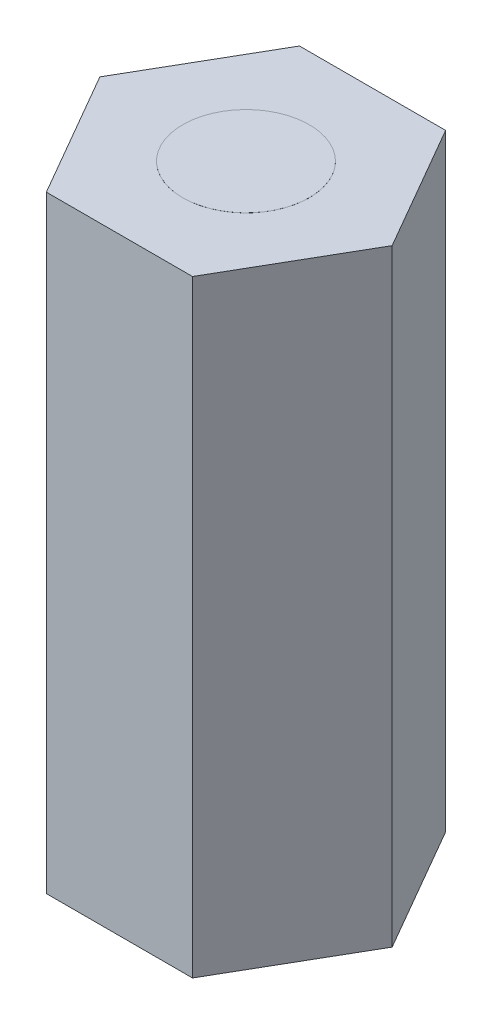
ISO-10303-21;
HEADER;
FILE_DESCRIPTION(('STEP AP214'),'2;1');
FILE_NAME('part.step','',(''),(''),'','','');
FILE_SCHEMA(('AUTOMOTIVE_DESIGN { 1 0 10303 214 1 1 1 1 }'));
ENDSEC;
DATA;
#1=APPLICATION_CONTEXT('core data for automotive mechanical design processes');
#2=APPLICATION_PROTOCOL_DEFINITION('international standard','automotive_design',2000,#1);
#3=PRODUCT_CONTEXT('',#1,'mechanical');
#4=PRODUCT('Part','Part','',(#3));
#5=PRODUCT_RELATED_PRODUCT_CATEGORY('part','',(#4));
#6=PRODUCT_DEFINITION_FORMATION('','',#4);
#7=PRODUCT_DEFINITION_CONTEXT('part definition',#1,'design');
#8=PRODUCT_DEFINITION('design','',#6,#7);
#9=PRODUCT_DEFINITION_SHAPE('','',#8);
#10=(LENGTH_UNIT() NAMED_UNIT(*) SI_UNIT(.MILLI.,.METRE.));
#11=(NAMED_UNIT(*) PLANE_ANGLE_UNIT() SI_UNIT($,.RADIAN.));
#12=(NAMED_UNIT(*) SI_UNIT($,.STERADIAN.) SOLID_ANGLE_UNIT());
#13=UNCERTAINTY_MEASURE_WITH_UNIT(LENGTH_MEASURE(1.E-05),#10,'distance_accuracy_value','');
#14=(GEOMETRIC_REPRESENTATION_CONTEXT(3) GLOBAL_UNCERTAINTY_ASSIGNED_CONTEXT((#13)) GLOBAL_UNIT_ASSIGNED_CONTEXT((#10,
#11,#12)) REPRESENTATION_CONTEXT('',''));
#15=CARTESIAN_POINT('',(0.,0.,0.));
#16=DIRECTION('',(0.,0.,1.));
#17=DIRECTION('',(1.,0.,0.));
#18=AXIS2_PLACEMENT_3D('',#15,#16,#17);
#19=CARTESIAN_POINT('',(-1.44337567297409,12.,-2.49999999999999));
#20=DIRECTION('',(0.866025403784441,0.,0.499999999999995));
#21=DIRECTION('',(0.499999999999995,0.,-0.866025403784442));
#22=AXIS2_PLACEMENT_3D('',#19,#20,#21);
#23=PLANE('',#22);
#24=DIRECTION('',(-0.499999999999995,0.,0.866025403784441));
#25=VECTOR('',#24,1.);
#26=CARTESIAN_POINT('',(-1.44337567297409,0.,-2.49999999999999));
#27=LINE('',#26,#25);
#28=CARTESIAN_POINT('',(-1.44337567297409,0.,-2.49999999999999));
#29=VERTEX_POINT('',#28);
#30=CARTESIAN_POINT('',(-2.88675134594813,0.,0.));
#31=VERTEX_POINT('',#30);
#32=EDGE_CURVE('E134',#29,#31,#27,.T.);
#33=ORIENTED_EDGE('',*,*,#32,.T.);
#34=DIRECTION('',(0.,-1.,0.));
#35=VECTOR('',#34,1.);
#36=CARTESIAN_POINT('',(-2.88675134594813,12.,0.));
#37=LINE('',#36,#35);
#38=CARTESIAN_POINT('',(-2.88675134594813,12.,0.));
#39=VERTEX_POINT('',#38);
#40=EDGE_CURVE('E46',#39,#31,#37,.T.);
#41=ORIENTED_EDGE('',*,*,#40,.F.);
#42=DIRECTION('',(-0.499999999999995,0.,0.866025403784441));
#43=VECTOR('',#42,1.);
#44=CARTESIAN_POINT('',(-1.44337567297409,12.,-2.49999999999999));
#45=LINE('',#44,#43);
#46=CARTESIAN_POINT('',(-1.44337567297409,12.,-2.49999999999999));
#47=VERTEX_POINT('',#46);
#48=EDGE_CURVE('E151',#47,#39,#45,.T.);
#49=ORIENTED_EDGE('',*,*,#48,.F.);
#50=DIRECTION('',(0.,-1.,0.));
#51=VECTOR('',#50,1.);
#52=CARTESIAN_POINT('',(-1.44337567297409,12.,-2.49999999999999));
#53=LINE('',#52,#51);
#54=EDGE_CURVE('E130',#47,#29,#53,.T.);
#55=ORIENTED_EDGE('',*,*,#54,.T.);
#56=EDGE_LOOP('',(#33,#41,#49,#55));
#57=FACE_BOUND('',#56,.T.);
#58=ADVANCED_FACE('F43',(#57),#23,.F.);
#59=CARTESIAN_POINT('',(-2.88675134594813,12.,0.));
#60=DIRECTION('',(0.866025403784438,0.,-0.500000000000001));
#61=DIRECTION('',(-0.500000000000001,0.,-0.866025403784438));
#62=AXIS2_PLACEMENT_3D('',#59,#60,#61);
#63=PLANE('',#62);
#64=DIRECTION('',(0.500000000000001,0.,0.866025403784438));
#65=VECTOR('',#64,1.);
#66=CARTESIAN_POINT('',(-2.88675134594813,0.,0.));
#67=LINE('',#66,#65);
#68=CARTESIAN_POINT('',(-1.44337567297406,0.,2.50000000000001));
#69=VERTEX_POINT('',#68);
#70=EDGE_CURVE('E138',#31,#69,#67,.T.);
#71=ORIENTED_EDGE('',*,*,#70,.T.);
#72=DIRECTION('',(0.,-1.,0.));
#73=VECTOR('',#72,1.);
#74=CARTESIAN_POINT('',(-1.44337567297406,12.,2.50000000000001));
#75=LINE('',#74,#73);
#76=CARTESIAN_POINT('',(-1.44337567297406,12.,2.50000000000001));
#77=VERTEX_POINT('',#76);
#78=EDGE_CURVE('E157',#77,#69,#75,.T.);
#79=ORIENTED_EDGE('',*,*,#78,.F.);
#80=DIRECTION('',(0.500000000000001,0.,0.866025403784438));
#81=VECTOR('',#80,1.);
#82=CARTESIAN_POINT('',(-2.88675134594813,12.,0.));
#83=LINE('',#82,#81);
#84=EDGE_CURVE('E99',#39,#77,#83,.T.);
#85=ORIENTED_EDGE('',*,*,#84,.F.);
#86=ORIENTED_EDGE('',*,*,#40,.T.);
#87=EDGE_LOOP('',(#71,#79,#85,#86));
#88=FACE_BOUND('',#87,.T.);
#89=ADVANCED_FACE('F164',(#88),#63,.F.);
#90=CARTESIAN_POINT('',(-1.44337567297406,12.,2.50000000000001));
#91=DIRECTION('',(0.,0.,-1.));
#92=DIRECTION('',(-1.,0.,0.));
#93=AXIS2_PLACEMENT_3D('',#90,#91,#92);
#94=PLANE('',#93);
#95=DIRECTION('',(1.,0.,0.));
#96=VECTOR('',#95,1.);
#97=CARTESIAN_POINT('',(-1.44337567297406,0.,2.50000000000001));
#98=LINE('',#97,#96);
#99=CARTESIAN_POINT('',(1.44337567297408,0.,2.5));
#100=VERTEX_POINT('',#99);
#101=EDGE_CURVE('E142',#69,#100,#98,.T.);
#102=ORIENTED_EDGE('',*,*,#101,.T.);
#103=DIRECTION('',(0.,-1.,0.));
#104=VECTOR('',#103,1.);
#105=CARTESIAN_POINT('',(1.44337567297408,12.,2.5));
#106=LINE('',#105,#104);
#107=CARTESIAN_POINT('',(1.44337567297408,12.,2.5));
#108=VERTEX_POINT('',#107);
#109=EDGE_CURVE('E123',#108,#100,#106,.T.);
#110=ORIENTED_EDGE('',*,*,#109,.F.);
#111=DIRECTION('',(1.,0.,0.));
#112=VECTOR('',#111,1.);
#113=CARTESIAN_POINT('',(-1.44337567297406,12.,2.50000000000001));
#114=LINE('',#113,#112);
#115=EDGE_CURVE('E112',#77,#108,#114,.T.);
#116=ORIENTED_EDGE('',*,*,#115,.F.);
#117=ORIENTED_EDGE('',*,*,#78,.T.);
#118=EDGE_LOOP('',(#102,#110,#116,#117));
#119=FACE_BOUND('',#118,.T.);
#120=ADVANCED_FACE('F170',(#119),#94,.F.);
#121=CARTESIAN_POINT('',(1.44337567297408,12.,2.5));
#122=DIRECTION('',(-0.866025403784442,0.,-0.499999999999995));
#123=DIRECTION('',(-0.499999999999995,0.,0.866025403784442));
#124=AXIS2_PLACEMENT_3D('',#121,#122,#123);
#125=PLANE('',#124);
#126=DIRECTION('',(0.499999999999995,0.,-0.866025403784441));
#127=VECTOR('',#126,1.);
#128=CARTESIAN_POINT('',(1.44337567297408,0.,2.5));
#129=LINE('',#128,#127);
#130=CARTESIAN_POINT('',(2.88675134594813,0.,0.));
#131=VERTEX_POINT('',#130);
#132=EDGE_CURVE('E121',#100,#131,#129,.T.);
#133=ORIENTED_EDGE('',*,*,#132,.T.);
#134=DIRECTION('',(0.,-1.,0.));
#135=VECTOR('',#134,1.);
#136=CARTESIAN_POINT('',(2.88675134594813,12.,0.));
#137=LINE('',#136,#135);
#138=CARTESIAN_POINT('',(2.88675134594813,12.,0.));
#139=VERTEX_POINT('',#138);
#140=EDGE_CURVE('E118',#139,#131,#137,.T.);
#141=ORIENTED_EDGE('',*,*,#140,.F.);
#142=DIRECTION('',(0.499999999999995,0.,-0.866025403784441));
#143=VECTOR('',#142,1.);
#144=CARTESIAN_POINT('',(1.44337567297408,12.,2.5));
#145=LINE('',#144,#143);
#146=EDGE_CURVE('E106',#108,#139,#145,.T.);
#147=ORIENTED_EDGE('',*,*,#146,.F.);
#148=ORIENTED_EDGE('',*,*,#109,.T.);
#149=EDGE_LOOP('',(#133,#141,#147,#148));
#150=FACE_BOUND('',#149,.T.);
#151=ADVANCED_FACE('F119',(#150),#125,.F.);
#152=CARTESIAN_POINT('',(2.88675134594813,12.,0.));
#153=DIRECTION('',(-0.866025403784435,0.,0.500000000000007));
#154=DIRECTION('',(0.500000000000007,0.,0.866025403784435));
#155=AXIS2_PLACEMENT_3D('',#152,#153,#154);
#156=PLANE('',#155);
#157=DIRECTION('',(-0.500000000000007,0.,-0.866025403784435));
#158=VECTOR('',#157,1.);
#159=CARTESIAN_POINT('',(2.88675134594813,0.,0.));
#160=LINE('',#159,#158);
#161=CARTESIAN_POINT('',(1.44337567297404,0.,-2.50000000000002));
#162=VERTEX_POINT('',#161);
#163=EDGE_CURVE('E84',#131,#162,#160,.T.);
#164=ORIENTED_EDGE('',*,*,#163,.T.);
#165=DIRECTION('',(0.,-1.,0.));
#166=VECTOR('',#165,1.);
#167=CARTESIAN_POINT('',(1.44337567297404,12.,-2.50000000000002));
#168=LINE('',#167,#166);
#169=CARTESIAN_POINT('',(1.44337567297404,12.,-2.50000000000002));
#170=VERTEX_POINT('',#169);
#171=EDGE_CURVE('E124',#170,#162,#168,.T.);
#172=ORIENTED_EDGE('',*,*,#171,.F.);
#173=DIRECTION('',(-0.500000000000007,0.,-0.866025403784435));
#174=VECTOR('',#173,1.);
#175=CARTESIAN_POINT('',(2.88675134594813,12.,0.));
#176=LINE('',#175,#174);
#177=EDGE_CURVE('E110',#139,#170,#176,.T.);
#178=ORIENTED_EDGE('',*,*,#177,.F.);
#179=ORIENTED_EDGE('',*,*,#140,.T.);
#180=EDGE_LOOP('',(#164,#172,#178,#179));
#181=FACE_BOUND('',#180,.T.);
#182=ADVANCED_FACE('F126',(#181),#156,.F.);
#183=CARTESIAN_POINT('',(1.44337567297404,12.,-2.50000000000002));
#184=DIRECTION('',(0.,0.,1.));
#185=DIRECTION('',(1.,0.,0.));
#186=AXIS2_PLACEMENT_3D('',#183,#184,#185);
#187=PLANE('',#186);
#188=DIRECTION('',(-1.,0.,0.));
#189=VECTOR('',#188,1.);
#190=CARTESIAN_POINT('',(1.44337567297404,0.,-2.50000000000002));
#191=LINE('',#190,#189);
#192=EDGE_CURVE('E90',#162,#29,#191,.T.);
#193=ORIENTED_EDGE('',*,*,#192,.T.);
#194=ORIENTED_EDGE('',*,*,#54,.F.);
#195=DIRECTION('',(-1.,0.,0.));
#196=VECTOR('',#195,1.);
#197=CARTESIAN_POINT('',(1.44337567297404,12.,-2.50000000000002));
#198=LINE('',#197,#196);
#199=EDGE_CURVE('E61',#170,#47,#198,.T.);
#200=ORIENTED_EDGE('',*,*,#199,.F.);
#201=ORIENTED_EDGE('',*,*,#171,.T.);
#202=EDGE_LOOP('',(#193,#194,#200,#201));
#203=FACE_BOUND('',#202,.T.);
#204=ADVANCED_FACE('F190',(#203),#187,.F.);
#205=CARTESIAN_POINT('',(0.,12.,0.));
#206=DIRECTION('',(0.,1.,0.));
#207=DIRECTION('',(0.,0.,1.));
#208=AXIS2_PLACEMENT_3D('',#205,#206,#207);
#209=PLANE('',#208);
#210=CARTESIAN_POINT('',(0.,12.,0.));
#211=DIRECTION('',(0.,1.,0.));
#212=DIRECTION('',(0.,0.,1.));
#213=AXIS2_PLACEMENT_3D('',#210,#211,#212);
#214=CIRCLE('',#213,1.25);
#215=CARTESIAN_POINT('',(0.,12.,1.25));
#216=VERTEX_POINT('',#215);
#217=EDGE_CURVE('E11',#216,#216,#214,.T.);
#218=ORIENTED_EDGE('',*,*,#217,.F.);
#219=EDGE_LOOP('',(#218));
#220=FACE_BOUND('',#219,.T.);
#221=ORIENTED_EDGE('',*,*,#48,.T.);
#222=ORIENTED_EDGE('',*,*,#84,.T.);
#223=ORIENTED_EDGE('',*,*,#115,.T.);
#224=ORIENTED_EDGE('',*,*,#146,.T.);
#225=ORIENTED_EDGE('',*,*,#177,.T.);
#226=ORIENTED_EDGE('',*,*,#199,.T.);
#227=EDGE_LOOP('',(#221,#222,#223,#224,#225,#226));
#228=FACE_BOUND('',#227,.T.);
#229=ADVANCED_FACE('F108',(#220,#228),#209,.T.);
#230=CARTESIAN_POINT('',(0.,0.,0.));
#231=DIRECTION('',(0.,1.,0.));
#232=DIRECTION('',(0.,0.,1.));
#233=AXIS2_PLACEMENT_3D('',#230,#231,#232);
#234=PLANE('',#233);
#235=ORIENTED_EDGE('',*,*,#32,.F.);
#236=ORIENTED_EDGE('',*,*,#192,.F.);
#237=ORIENTED_EDGE('',*,*,#163,.F.);
#238=ORIENTED_EDGE('',*,*,#132,.F.);
#239=ORIENTED_EDGE('',*,*,#101,.F.);
#240=ORIENTED_EDGE('',*,*,#70,.F.);
#241=EDGE_LOOP('',(#235,#236,#237,#238,#239,#240));
#242=FACE_BOUND('',#241,.T.);
#243=ADVANCED_FACE('F169',(#242),#234,.F.);
#244=CARTESIAN_POINT('',(0.,12.001,0.));
#245=DIRECTION('',(0.,-1.,0.));
#246=DIRECTION('',(0.,0.,-1.));
#247=AXIS2_PLACEMENT_3D('',#244,#245,#246);
#248=CYLINDRICAL_SURFACE('',#247,1.25);
#249=CARTESIAN_POINT('',(0.,12.001,0.));
#250=DIRECTION('',(0.,1.,0.));
#251=DIRECTION('',(0.,0.,1.));
#252=AXIS2_PLACEMENT_3D('',#249,#250,#251);
#253=CIRCLE('',#252,1.25);
#254=CARTESIAN_POINT('',(0.,12.001,1.25));
#255=VERTEX_POINT('',#254);
#256=EDGE_CURVE('E139',#255,#255,#253,.T.);
#257=ORIENTED_EDGE('',*,*,#256,.F.);
#258=EDGE_LOOP('',(#257));
#259=FACE_BOUND('',#258,.T.);
#260=ORIENTED_EDGE('',*,*,#217,.T.);
#261=EDGE_LOOP('',(#260));
#262=FACE_BOUND('',#261,.T.);
#263=ADVANCED_FACE('F183',(#259,#262),#248,.T.);
#264=CARTESIAN_POINT('',(0.,12.001,0.));
#265=DIRECTION('',(0.,1.,0.));
#266=DIRECTION('',(0.,0.,1.));
#267=AXIS2_PLACEMENT_3D('',#264,#265,#266);
#268=PLANE('',#267);
#269=ORIENTED_EDGE('',*,*,#256,.T.);
#270=EDGE_LOOP('',(#269));
#271=FACE_BOUND('',#270,.T.);
#272=ADVANCED_FACE('F181',(#271),#268,.T.);
#273=CLOSED_SHELL('',(#58,#89,#120,#151,#182,#204,#229,#243,#263,#272));
#274=MANIFOLD_SOLID_BREP('B2',#273);
#275=ADVANCED_BREP_SHAPE_REPRESENTATION('',(#18,#274),#14);
#276=SHAPE_DEFINITION_REPRESENTATION(#9,#275);
ENDSEC;
END-ISO-10303-21;
